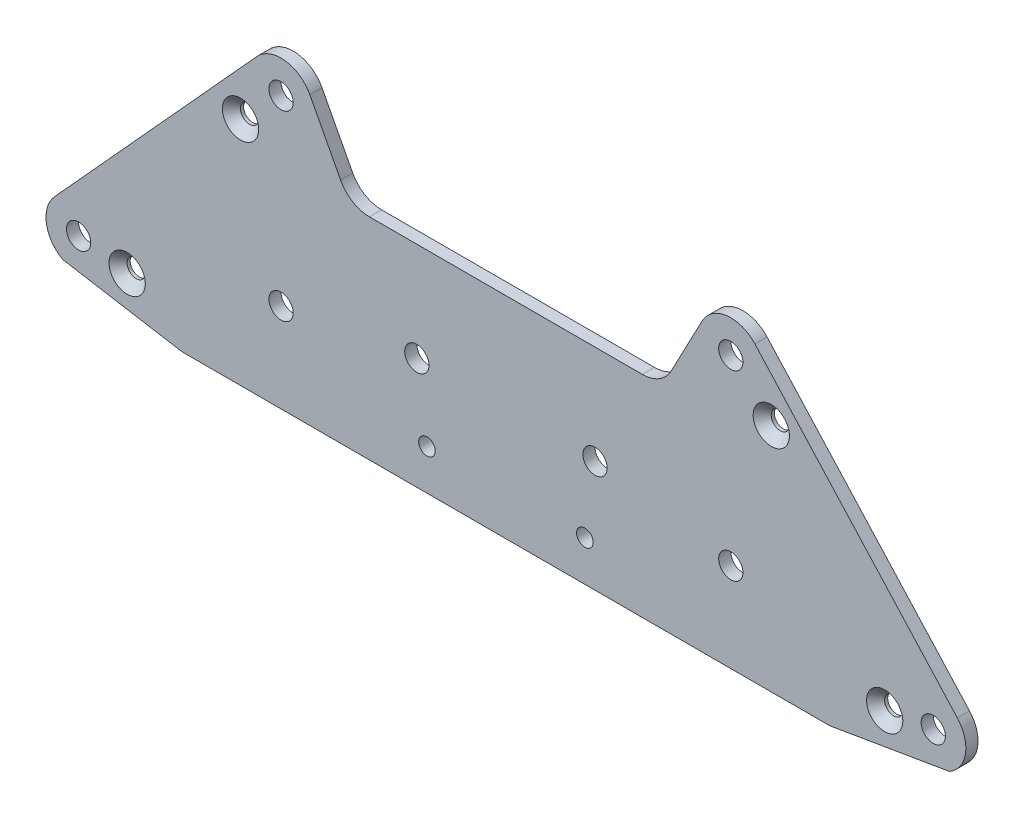
ISO-10303-21;
HEADER;
FILE_DESCRIPTION(('STEP AP214'),'2;1');
FILE_NAME('part.step','',(''),(''),'','','');
FILE_SCHEMA(('AUTOMOTIVE_DESIGN { 1 0 10303 214 1 1 1 1 }'));
ENDSEC;
DATA;
#1=APPLICATION_CONTEXT('core data for automotive mechanical design processes');
#2=APPLICATION_PROTOCOL_DEFINITION('international standard','automotive_design',2000,#1);
#3=PRODUCT_CONTEXT('',#1,'mechanical');
#4=PRODUCT('Part','Part','',(#3));
#5=PRODUCT_RELATED_PRODUCT_CATEGORY('part','',(#4));
#6=PRODUCT_DEFINITION_FORMATION('','',#4);
#7=PRODUCT_DEFINITION_CONTEXT('part definition',#1,'design');
#8=PRODUCT_DEFINITION('design','',#6,#7);
#9=PRODUCT_DEFINITION_SHAPE('','',#8);
#10=(LENGTH_UNIT() NAMED_UNIT(*) SI_UNIT(.MILLI.,.METRE.));
#11=(NAMED_UNIT(*) PLANE_ANGLE_UNIT() SI_UNIT($,.RADIAN.));
#12=(NAMED_UNIT(*) SI_UNIT($,.STERADIAN.) SOLID_ANGLE_UNIT());
#13=UNCERTAINTY_MEASURE_WITH_UNIT(LENGTH_MEASURE(1.E-05),#10,'distance_accuracy_value','');
#14=(GEOMETRIC_REPRESENTATION_CONTEXT(3) GLOBAL_UNCERTAINTY_ASSIGNED_CONTEXT((#13)) GLOBAL_UNIT_ASSIGNED_CONTEXT((#10,
#11,#12)) REPRESENTATION_CONTEXT('',''));
#15=CARTESIAN_POINT('',(0.,0.,0.));
#16=DIRECTION('',(0.,0.,1.));
#17=DIRECTION('',(1.,0.,0.));
#18=AXIS2_PLACEMENT_3D('',#15,#16,#17);
#19=CARTESIAN_POINT('',(105.536479783985,0.,3.));
#20=DIRECTION('',(0.,0.,-1.));
#21=DIRECTION('',(-1.,0.,0.));
#22=AXIS2_PLACEMENT_3D('',#19,#20,#21);
#23=PLANE('',#22);
#24=CARTESIAN_POINT('',(93.5364797839854,-2.00000000000001,3.));
#25=DIRECTION('',(0.,0.,1.));
#26=DIRECTION('',(1.,0.,0.));
#27=AXIS2_PLACEMENT_3D('',#24,#25,#26);
#28=CIRCLE('',#27,4.48);
#29=CARTESIAN_POINT('',(98.0164797839853,-2.00000000000001,3.));
#30=VERTEX_POINT('',#29);
#31=EDGE_CURVE('E369',#30,#30,#28,.T.);
#32=ORIENTED_EDGE('',*,*,#31,.F.);
#33=EDGE_LOOP('',(#32));
#34=FACE_BOUND('',#33,.T.);
#35=CARTESIAN_POINT('',(65.5364797839853,45.,3.));
#36=DIRECTION('',(0.,0.,1.));
#37=DIRECTION('',(1.,0.,0.));
#38=AXIS2_PLACEMENT_3D('',#35,#36,#37);
#39=CIRCLE('',#38,4.48);
#40=CARTESIAN_POINT('',(70.0164797839853,45.,3.));
#41=VERTEX_POINT('',#40);
#42=EDGE_CURVE('E376',#41,#41,#39,.T.);
#43=ORIENTED_EDGE('',*,*,#42,.F.);
#44=EDGE_LOOP('',(#43));
#45=FACE_BOUND('',#44,.T.);
#46=CARTESIAN_POINT('',(-65.5364797839853,45.,3.));
#47=DIRECTION('',(0.,0.,1.));
#48=DIRECTION('',(1.,0.,0.));
#49=AXIS2_PLACEMENT_3D('',#46,#47,#48);
#50=CIRCLE('',#49,4.48);
#51=CARTESIAN_POINT('',(-61.0564797839853,45.,3.));
#52=VERTEX_POINT('',#51);
#53=EDGE_CURVE('E385',#52,#52,#50,.T.);
#54=ORIENTED_EDGE('',*,*,#53,.F.);
#55=EDGE_LOOP('',(#54));
#56=FACE_BOUND('',#55,.T.);
#57=CARTESIAN_POINT('',(-93.5364797839853,-2.,3.));
#58=DIRECTION('',(0.,0.,1.));
#59=DIRECTION('',(1.,0.,0.));
#60=AXIS2_PLACEMENT_3D('',#57,#58,#59);
#61=CIRCLE('',#60,4.48);
#62=CARTESIAN_POINT('',(-89.0564797839853,-2.,3.));
#63=VERTEX_POINT('',#62);
#64=EDGE_CURVE('E394',#63,#63,#61,.T.);
#65=ORIENTED_EDGE('',*,*,#64,.F.);
#66=EDGE_LOOP('',(#65));
#67=FACE_BOUND('',#66,.T.);
#68=CARTESIAN_POINT('',(19.5,-2.,3.));
#69=DIRECTION('',(0.,0.,1.));
#70=DIRECTION('',(1.,0.,0.));
#71=AXIS2_PLACEMENT_3D('',#68,#69,#70);
#72=CIRCLE('',#71,2.04999999999999);
#73=CARTESIAN_POINT('',(21.55,-2.,3.));
#74=VERTEX_POINT('',#73);
#75=EDGE_CURVE('E403',#74,#74,#72,.T.);
#76=ORIENTED_EDGE('',*,*,#75,.F.);
#77=EDGE_LOOP('',(#76));
#78=FACE_BOUND('',#77,.T.);
#79=CARTESIAN_POINT('',(-19.5,-2.,3.));
#80=DIRECTION('',(0.,0.,1.));
#81=DIRECTION('',(1.,0.,0.));
#82=AXIS2_PLACEMENT_3D('',#79,#80,#81);
#83=CIRCLE('',#82,2.04999999999999);
#84=CARTESIAN_POINT('',(-17.45,-2.,3.));
#85=VERTEX_POINT('',#84);
#86=EDGE_CURVE('E407',#85,#85,#83,.T.);
#87=ORIENTED_EDGE('',*,*,#86,.F.);
#88=EDGE_LOOP('',(#87));
#89=FACE_BOUND('',#88,.T.);
#90=CARTESIAN_POINT('',(-21.9984081380424,15.5854946308941,3.));
#91=DIRECTION('',(0.,0.,1.));
#92=DIRECTION('',(1.,0.,0.));
#93=AXIS2_PLACEMENT_3D('',#90,#91,#92);
#94=CIRCLE('',#93,2.99999999999999);
#95=CARTESIAN_POINT('',(-18.9984081380424,15.5854946308941,3.));
#96=VERTEX_POINT('',#95);
#97=EDGE_CURVE('E422',#96,#96,#94,.T.);
#98=ORIENTED_EDGE('',*,*,#97,.F.);
#99=EDGE_LOOP('',(#98));
#100=FACE_BOUND('',#99,.T.);
#101=CARTESIAN_POINT('',(-55.5364797839854,10.,3.));
#102=DIRECTION('',(0.,0.,1.));
#103=DIRECTION('',(1.,0.,0.));
#104=AXIS2_PLACEMENT_3D('',#101,#102,#103);
#105=CIRCLE('',#104,2.99999999999999);
#106=CARTESIAN_POINT('',(-52.5364797839854,10.,3.));
#107=VERTEX_POINT('',#106);
#108=EDGE_CURVE('E434',#107,#107,#105,.T.);
#109=ORIENTED_EDGE('',*,*,#108,.F.);
#110=EDGE_LOOP('',(#109));
#111=FACE_BOUND('',#110,.T.);
#112=CARTESIAN_POINT('',(55.5364797839853,55.,3.));
#113=DIRECTION('',(0.,0.,1.));
#114=DIRECTION('',(1.,0.,0.));
#115=AXIS2_PLACEMENT_3D('',#112,#113,#114);
#116=CIRCLE('',#115,3.);
#117=CARTESIAN_POINT('',(58.5364797839853,55.,3.));
#118=VERTEX_POINT('',#117);
#119=EDGE_CURVE('E446',#118,#118,#116,.T.);
#120=ORIENTED_EDGE('',*,*,#119,.F.);
#121=EDGE_LOOP('',(#120));
#122=FACE_BOUND('',#121,.T.);
#123=CARTESIAN_POINT('',(105.536479783985,0.,3.));
#124=DIRECTION('',(0.,0.,1.));
#125=DIRECTION('',(1.,0.,0.));
#126=AXIS2_PLACEMENT_3D('',#123,#124,#125);
#127=CIRCLE('',#126,3.00000000000001);
#128=CARTESIAN_POINT('',(108.536479783985,0.,3.));
#129=VERTEX_POINT('',#128);
#130=EDGE_CURVE('E172',#129,#129,#127,.T.);
#131=ORIENTED_EDGE('',*,*,#130,.F.);
#132=EDGE_LOOP('',(#131));
#133=FACE_BOUND('',#132,.T.);
#134=DIRECTION('',(0.985942111915208,0.16708725849741,0.));
#135=VECTOR('',#134,1.);
#136=CARTESIAN_POINT('',(80.,-12.,3.));
#137=LINE('',#136,#135);
#138=CARTESIAN_POINT('',(80.,-12.,3.));
#139=VERTEX_POINT('',#138);
#140=CARTESIAN_POINT('',(109.503808991231,-6.99999999999999,3.));
#141=VERTEX_POINT('',#140);
#142=EDGE_CURVE('E195',#139,#141,#137,.T.);
#143=ORIENTED_EDGE('',*,*,#142,.T.);
#144=CARTESIAN_POINT('',(105.536479783985,0.,3.));
#145=DIRECTION('',(0.,0.,1.));
#146=DIRECTION('',(-1.,0.,0.));
#147=AXIS2_PLACEMENT_3D('',#144,#145,#146);
#148=CIRCLE('',#147,8.04609849794704);
#149=CARTESIAN_POINT('',(111.490110497107,5.41239155738356,3.));
#150=VERTEX_POINT('',#149);
#151=EDGE_CURVE('E113',#141,#150,#148,.T.);
#152=ORIENTED_EDGE('',*,*,#151,.T.);
#153=DIRECTION('',(-0.672672793996313,0.739940073395944,0.));
#154=VECTOR('',#153,1.);
#155=CARTESIAN_POINT('',(61.4901104971073,60.4123915573836,3.));
#156=LINE('',#155,#154);
#157=CARTESIAN_POINT('',(61.4901104971073,60.4123915573836,3.));
#158=VERTEX_POINT('',#157);
#159=EDGE_CURVE('E228',#150,#158,#156,.T.);
#160=ORIENTED_EDGE('',*,*,#159,.T.);
#161=CARTESIAN_POINT('',(55.5364797839853,55.,3.));
#162=DIRECTION('',(0.,0.,1.));
#163=DIRECTION('',(-1.,0.,0.));
#164=AXIS2_PLACEMENT_3D('',#161,#162,#163);
#165=CIRCLE('',#164,8.04609849794704);
#166=CARTESIAN_POINT('',(48.414233746898,58.743435911814,3.));
#167=VERTEX_POINT('',#166);
#168=EDGE_CURVE('E247',#158,#167,#165,.T.);
#169=ORIENTED_EDGE('',*,*,#168,.T.);
#170=DIRECTION('',(-0.465248581380051,-0.885180070677063,0.));
#171=VECTOR('',#170,1.);
#172=CARTESIAN_POINT('',(40.8241969551014,44.302662586133,3.));
#173=LINE('',#172,#171);
#174=CARTESIAN_POINT('',(40.8241969551014,44.302662586133,3.));
#175=VERTEX_POINT('',#174);
#176=EDGE_CURVE('E244',#167,#175,#173,.T.);
#177=ORIENTED_EDGE('',*,*,#176,.T.);
#178=CARTESIAN_POINT('',(33.701950918014,48.046098497947,3.));
#179=DIRECTION('',(0.,0.,-1.));
#180=DIRECTION('',(1.,0.,0.));
#181=AXIS2_PLACEMENT_3D('',#178,#179,#180);
#182=CIRCLE('',#181,8.04609849794704);
#183=CARTESIAN_POINT('',(33.701950918014,40.,3.));
#184=VERTEX_POINT('',#183);
#185=EDGE_CURVE('E246',#175,#184,#182,.T.);
#186=ORIENTED_EDGE('',*,*,#185,.T.);
#187=DIRECTION('',(-1.,0.,0.));
#188=VECTOR('',#187,1.);
#189=CARTESIAN_POINT('',(-33.7019509180141,40.,3.));
#190=LINE('',#189,#188);
#191=CARTESIAN_POINT('',(-33.7019509180141,40.,3.));
#192=VERTEX_POINT('',#191);
#193=EDGE_CURVE('E249',#184,#192,#190,.T.);
#194=ORIENTED_EDGE('',*,*,#193,.T.);
#195=CARTESIAN_POINT('',(-33.7019509180141,48.046098497947,3.));
#196=DIRECTION('',(0.,0.,-1.));
#197=DIRECTION('',(1.,0.,0.));
#198=AXIS2_PLACEMENT_3D('',#195,#196,#197);
#199=CIRCLE('',#198,8.04609849794705);
#200=CARTESIAN_POINT('',(-40.8241969551014,44.302662586133,3.));
#201=VERTEX_POINT('',#200);
#202=EDGE_CURVE('E255',#192,#201,#199,.T.);
#203=ORIENTED_EDGE('',*,*,#202,.T.);
#204=DIRECTION('',(-0.465248581380051,0.885180070677063,0.));
#205=VECTOR('',#204,1.);
#206=CARTESIAN_POINT('',(-48.414233746898,58.743435911814,3.));
#207=LINE('',#206,#205);
#208=CARTESIAN_POINT('',(-48.414233746898,58.743435911814,3.));
#209=VERTEX_POINT('',#208);
#210=EDGE_CURVE('E257',#201,#209,#207,.T.);
#211=ORIENTED_EDGE('',*,*,#210,.T.);
#212=CARTESIAN_POINT('',(-55.5364797839854,55.,3.));
#213=DIRECTION('',(0.,0.,1.));
#214=DIRECTION('',(-1.,0.,0.));
#215=AXIS2_PLACEMENT_3D('',#212,#213,#214);
#216=CIRCLE('',#215,8.04609849794704);
#217=CARTESIAN_POINT('',(-61.4901104971073,60.4123915573836,3.));
#218=VERTEX_POINT('',#217);
#219=EDGE_CURVE('E259',#209,#218,#216,.T.);
#220=ORIENTED_EDGE('',*,*,#219,.T.);
#221=DIRECTION('',(-0.672672793996313,-0.739940073395944,0.));
#222=VECTOR('',#221,1.);
#223=CARTESIAN_POINT('',(-111.490110497107,5.41239155738357,3.));
#224=LINE('',#223,#222);
#225=CARTESIAN_POINT('',(-111.490110497107,5.41239155738357,3.));
#226=VERTEX_POINT('',#225);
#227=EDGE_CURVE('E150',#218,#226,#224,.T.);
#228=ORIENTED_EDGE('',*,*,#227,.T.);
#229=CARTESIAN_POINT('',(-105.536479783985,0.,3.));
#230=DIRECTION('',(0.,0.,1.));
#231=DIRECTION('',(-1.,0.,0.));
#232=AXIS2_PLACEMENT_3D('',#229,#230,#231);
#233=CIRCLE('',#232,8.04609849794704);
#234=CARTESIAN_POINT('',(-109.503808991231,-7.,3.));
#235=VERTEX_POINT('',#234);
#236=EDGE_CURVE('E144',#226,#235,#233,.T.);
#237=ORIENTED_EDGE('',*,*,#236,.T.);
#238=DIRECTION('',(0.985942111915208,-0.16708725849741,0.));
#239=VECTOR('',#238,1.);
#240=CARTESIAN_POINT('',(-80.,-12.,3.));
#241=LINE('',#240,#239);
#242=CARTESIAN_POINT('',(-80.,-12.,3.));
#243=VERTEX_POINT('',#242);
#244=EDGE_CURVE('E148',#235,#243,#241,.T.);
#245=ORIENTED_EDGE('',*,*,#244,.T.);
#246=DIRECTION('',(1.,0.,0.));
#247=VECTOR('',#246,1.);
#248=CARTESIAN_POINT('',(-80.,-12.,3.));
#249=LINE('',#248,#247);
#250=EDGE_CURVE('E52',#243,#139,#249,.T.);
#251=ORIENTED_EDGE('',*,*,#250,.T.);
#252=EDGE_LOOP('',(#143,#152,#160,#169,#177,#186,#194,#203,#211,#220,#228,#237,#245,#251));
#253=FACE_BOUND('',#252,.T.);
#254=CARTESIAN_POINT('',(55.5364797839853,10.,3.));
#255=DIRECTION('',(0.,0.,1.));
#256=DIRECTION('',(1.,0.,0.));
#257=AXIS2_PLACEMENT_3D('',#254,#255,#256);
#258=CIRCLE('',#257,3.);
#259=CARTESIAN_POINT('',(58.5364797839853,10.,3.));
#260=VERTEX_POINT('',#259);
#261=EDGE_CURVE('E452',#260,#260,#258,.T.);
#262=ORIENTED_EDGE('',*,*,#261,.F.);
#263=EDGE_LOOP('',(#262));
#264=FACE_BOUND('',#263,.T.);
#265=CARTESIAN_POINT('',(-105.536479783985,0.,3.));
#266=DIRECTION('',(0.,0.,1.));
#267=DIRECTION('',(1.,0.,0.));
#268=AXIS2_PLACEMENT_3D('',#265,#266,#267);
#269=CIRCLE('',#268,2.99999999999999);
#270=CARTESIAN_POINT('',(-102.536479783985,0.,3.));
#271=VERTEX_POINT('',#270);
#272=EDGE_CURVE('E440',#271,#271,#269,.T.);
#273=ORIENTED_EDGE('',*,*,#272,.F.);
#274=EDGE_LOOP('',(#273));
#275=FACE_BOUND('',#274,.T.);
#276=CARTESIAN_POINT('',(-55.5364797839854,55.,3.));
#277=DIRECTION('',(0.,0.,1.));
#278=DIRECTION('',(1.,0.,0.));
#279=AXIS2_PLACEMENT_3D('',#276,#277,#278);
#280=CIRCLE('',#279,2.99999999999999);
#281=CARTESIAN_POINT('',(-52.5364797839854,55.,3.));
#282=VERTEX_POINT('',#281);
#283=EDGE_CURVE('E428',#282,#282,#280,.T.);
#284=ORIENTED_EDGE('',*,*,#283,.F.);
#285=EDGE_LOOP('',(#284));
#286=FACE_BOUND('',#285,.T.);
#287=CARTESIAN_POINT('',(21.9984081380424,15.5854946308941,3.));
#288=DIRECTION('',(0.,0.,1.));
#289=DIRECTION('',(1.,0.,0.));
#290=AXIS2_PLACEMENT_3D('',#287,#288,#289);
#291=CIRCLE('',#290,3.);
#292=CARTESIAN_POINT('',(24.9984081380424,15.5854946308941,3.));
#293=VERTEX_POINT('',#292);
#294=EDGE_CURVE('E416',#293,#293,#291,.T.);
#295=ORIENTED_EDGE('',*,*,#294,.F.);
#296=EDGE_LOOP('',(#295));
#297=FACE_BOUND('',#296,.T.);
#298=ADVANCED_FACE('F35',(#34,#45,#56,#67,#78,#89,#100,#111,#122,#133,#253,#264,#275,#286,#297),
#23,.F.);
#299=CARTESIAN_POINT('',(105.536479783985,0.,0.));
#300=DIRECTION('',(0.,0.,-1.));
#301=DIRECTION('',(-1.,0.,0.));
#302=AXIS2_PLACEMENT_3D('',#299,#300,#301);
#303=PLANE('',#302);
#304=CARTESIAN_POINT('',(93.5364797839854,-2.00000000000001,0.));
#305=DIRECTION('',(0.,0.,1.));
#306=DIRECTION('',(1.,0.,0.));
#307=AXIS2_PLACEMENT_3D('',#304,#305,#306);
#308=CIRCLE('',#307,2.25);
#309=CARTESIAN_POINT('',(95.7864797839854,-2.00000000000001,0.));
#310=VERTEX_POINT('',#309);
#311=EDGE_CURVE('E371',#310,#310,#308,.T.);
#312=ORIENTED_EDGE('',*,*,#311,.T.);
#313=EDGE_LOOP('',(#312));
#314=FACE_BOUND('',#313,.T.);
#315=CARTESIAN_POINT('',(65.5364797839853,45.,0.));
#316=DIRECTION('',(0.,0.,1.));
#317=DIRECTION('',(1.,0.,0.));
#318=AXIS2_PLACEMENT_3D('',#315,#316,#317);
#319=CIRCLE('',#318,2.25);
#320=CARTESIAN_POINT('',(67.7864797839853,45.,0.));
#321=VERTEX_POINT('',#320);
#322=EDGE_CURVE('E382',#321,#321,#319,.T.);
#323=ORIENTED_EDGE('',*,*,#322,.T.);
#324=EDGE_LOOP('',(#323));
#325=FACE_BOUND('',#324,.T.);
#326=CARTESIAN_POINT('',(-65.5364797839853,45.,0.));
#327=DIRECTION('',(0.,0.,1.));
#328=DIRECTION('',(1.,0.,0.));
#329=AXIS2_PLACEMENT_3D('',#326,#327,#328);
#330=CIRCLE('',#329,2.25);
#331=CARTESIAN_POINT('',(-63.2864797839853,45.,0.));
#332=VERTEX_POINT('',#331);
#333=EDGE_CURVE('E391',#332,#332,#330,.T.);
#334=ORIENTED_EDGE('',*,*,#333,.T.);
#335=EDGE_LOOP('',(#334));
#336=FACE_BOUND('',#335,.T.);
#337=CARTESIAN_POINT('',(-93.5364797839853,-2.,0.));
#338=DIRECTION('',(0.,0.,1.));
#339=DIRECTION('',(1.,0.,0.));
#340=AXIS2_PLACEMENT_3D('',#337,#338,#339);
#341=CIRCLE('',#340,2.25);
#342=CARTESIAN_POINT('',(-91.2864797839853,-2.,0.));
#343=VERTEX_POINT('',#342);
#344=EDGE_CURVE('E400',#343,#343,#341,.T.);
#345=ORIENTED_EDGE('',*,*,#344,.T.);
#346=EDGE_LOOP('',(#345));
#347=FACE_BOUND('',#346,.T.);
#348=CARTESIAN_POINT('',(19.5,-2.,0.));
#349=DIRECTION('',(0.,0.,1.));
#350=DIRECTION('',(1.,0.,0.));
#351=AXIS2_PLACEMENT_3D('',#348,#349,#350);
#352=CIRCLE('',#351,2.04999999999999);
#353=CARTESIAN_POINT('',(21.55,-2.,0.));
#354=VERTEX_POINT('',#353);
#355=EDGE_CURVE('E404',#354,#354,#352,.T.);
#356=ORIENTED_EDGE('',*,*,#355,.T.);
#357=EDGE_LOOP('',(#356));
#358=FACE_BOUND('',#357,.T.);
#359=CARTESIAN_POINT('',(-19.5,-2.,0.));
#360=DIRECTION('',(0.,0.,1.));
#361=DIRECTION('',(1.,0.,0.));
#362=AXIS2_PLACEMENT_3D('',#359,#360,#361);
#363=CIRCLE('',#362,2.04999999999999);
#364=CARTESIAN_POINT('',(-17.45,-2.,0.));
#365=VERTEX_POINT('',#364);
#366=EDGE_CURVE('E410',#365,#365,#363,.T.);
#367=ORIENTED_EDGE('',*,*,#366,.T.);
#368=EDGE_LOOP('',(#367));
#369=FACE_BOUND('',#368,.T.);
#370=CARTESIAN_POINT('',(-21.9984081380424,15.5854946308941,0.));
#371=DIRECTION('',(0.,0.,1.));
#372=DIRECTION('',(1.,0.,0.));
#373=AXIS2_PLACEMENT_3D('',#370,#371,#372);
#374=CIRCLE('',#373,2.99999999999999);
#375=CARTESIAN_POINT('',(-18.9984081380424,15.5854946308941,0.));
#376=VERTEX_POINT('',#375);
#377=EDGE_CURVE('E419',#376,#376,#374,.T.);
#378=ORIENTED_EDGE('',*,*,#377,.T.);
#379=EDGE_LOOP('',(#378));
#380=FACE_BOUND('',#379,.T.);
#381=CARTESIAN_POINT('',(-55.5364797839854,10.,0.));
#382=DIRECTION('',(0.,0.,1.));
#383=DIRECTION('',(1.,0.,0.));
#384=AXIS2_PLACEMENT_3D('',#381,#382,#383);
#385=CIRCLE('',#384,2.99999999999999);
#386=CARTESIAN_POINT('',(-52.5364797839854,10.,0.));
#387=VERTEX_POINT('',#386);
#388=EDGE_CURVE('E431',#387,#387,#385,.T.);
#389=ORIENTED_EDGE('',*,*,#388,.T.);
#390=EDGE_LOOP('',(#389));
#391=FACE_BOUND('',#390,.T.);
#392=CARTESIAN_POINT('',(55.5364797839853,55.,0.));
#393=DIRECTION('',(0.,0.,1.));
#394=DIRECTION('',(1.,0.,0.));
#395=AXIS2_PLACEMENT_3D('',#392,#393,#394);
#396=CIRCLE('',#395,3.);
#397=CARTESIAN_POINT('',(58.5364797839853,55.,0.));
#398=VERTEX_POINT('',#397);
#399=EDGE_CURVE('E443',#398,#398,#396,.T.);
#400=ORIENTED_EDGE('',*,*,#399,.T.);
#401=EDGE_LOOP('',(#400));
#402=FACE_BOUND('',#401,.T.);
#403=CARTESIAN_POINT('',(105.536479783985,0.,0.));
#404=DIRECTION('',(0.,0.,1.));
#405=DIRECTION('',(1.,0.,0.));
#406=AXIS2_PLACEMENT_3D('',#403,#404,#405);
#407=CIRCLE('',#406,3.00000000000001);
#408=CARTESIAN_POINT('',(108.536479783985,0.,0.));
#409=VERTEX_POINT('',#408);
#410=EDGE_CURVE('E455',#409,#409,#407,.T.);
#411=ORIENTED_EDGE('',*,*,#410,.T.);
#412=EDGE_LOOP('',(#411));
#413=FACE_BOUND('',#412,.T.);
#414=DIRECTION('',(0.985942111915208,0.16708725849741,0.));
#415=VECTOR('',#414,1.);
#416=CARTESIAN_POINT('',(80.,-12.,0.));
#417=LINE('',#416,#415);
#418=CARTESIAN_POINT('',(80.,-12.,0.));
#419=VERTEX_POINT('',#418);
#420=CARTESIAN_POINT('',(109.503808991231,-6.99999999999999,0.));
#421=VERTEX_POINT('',#420);
#422=EDGE_CURVE('E168',#419,#421,#417,.T.);
#423=ORIENTED_EDGE('',*,*,#422,.F.);
#424=DIRECTION('',(1.,0.,0.));
#425=VECTOR('',#424,1.);
#426=CARTESIAN_POINT('',(-80.,-12.,0.));
#427=LINE('',#426,#425);
#428=CARTESIAN_POINT('',(-80.,-12.,0.));
#429=VERTEX_POINT('',#428);
#430=EDGE_CURVE('E105',#429,#419,#427,.T.);
#431=ORIENTED_EDGE('',*,*,#430,.F.);
#432=DIRECTION('',(0.985942111915208,-0.16708725849741,0.));
#433=VECTOR('',#432,1.);
#434=CARTESIAN_POINT('',(-80.,-12.,0.));
#435=LINE('',#434,#433);
#436=CARTESIAN_POINT('',(-109.503808991231,-7.,0.));
#437=VERTEX_POINT('',#436);
#438=EDGE_CURVE('E99',#437,#429,#435,.T.);
#439=ORIENTED_EDGE('',*,*,#438,.F.);
#440=CARTESIAN_POINT('',(-105.536479783985,0.,0.));
#441=DIRECTION('',(0.,0.,1.));
#442=DIRECTION('',(-1.,0.,0.));
#443=AXIS2_PLACEMENT_3D('',#440,#441,#442);
#444=CIRCLE('',#443,8.04609849794704);
#445=CARTESIAN_POINT('',(-111.490110497107,5.41239155738357,0.));
#446=VERTEX_POINT('',#445);
#447=EDGE_CURVE('E158',#446,#437,#444,.T.);
#448=ORIENTED_EDGE('',*,*,#447,.F.);
#449=DIRECTION('',(-0.672672793996313,-0.739940073395944,0.));
#450=VECTOR('',#449,1.);
#451=CARTESIAN_POINT('',(-111.490110497107,5.41239155738357,0.));
#452=LINE('',#451,#450);
#453=CARTESIAN_POINT('',(-61.4901104971073,60.4123915573836,0.));
#454=VERTEX_POINT('',#453);
#455=EDGE_CURVE('E190',#454,#446,#452,.T.);
#456=ORIENTED_EDGE('',*,*,#455,.F.);
#457=CARTESIAN_POINT('',(-55.5364797839854,55.,0.));
#458=DIRECTION('',(0.,0.,1.));
#459=DIRECTION('',(-1.,0.,0.));
#460=AXIS2_PLACEMENT_3D('',#457,#458,#459);
#461=CIRCLE('',#460,8.04609849794704);
#462=CARTESIAN_POINT('',(-48.414233746898,58.743435911814,0.));
#463=VERTEX_POINT('',#462);
#464=EDGE_CURVE('E188',#463,#454,#461,.T.);
#465=ORIENTED_EDGE('',*,*,#464,.F.);
#466=DIRECTION('',(-0.465248581380051,0.885180070677063,0.));
#467=VECTOR('',#466,1.);
#468=CARTESIAN_POINT('',(-48.414233746898,58.743435911814,0.));
#469=LINE('',#468,#467);
#470=CARTESIAN_POINT('',(-40.8241969551014,44.302662586133,0.));
#471=VERTEX_POINT('',#470);
#472=EDGE_CURVE('E186',#471,#463,#469,.T.);
#473=ORIENTED_EDGE('',*,*,#472,.F.);
#474=CARTESIAN_POINT('',(-33.7019509180141,48.046098497947,0.));
#475=DIRECTION('',(0.,0.,-1.));
#476=DIRECTION('',(1.,0.,0.));
#477=AXIS2_PLACEMENT_3D('',#474,#475,#476);
#478=CIRCLE('',#477,8.04609849794705);
#479=CARTESIAN_POINT('',(-33.7019509180141,40.,0.));
#480=VERTEX_POINT('',#479);
#481=EDGE_CURVE('E184',#480,#471,#478,.T.);
#482=ORIENTED_EDGE('',*,*,#481,.F.);
#483=DIRECTION('',(-1.,0.,0.));
#484=VECTOR('',#483,1.);
#485=CARTESIAN_POINT('',(-33.7019509180141,40.,0.));
#486=LINE('',#485,#484);
#487=CARTESIAN_POINT('',(33.701950918014,40.,0.));
#488=VERTEX_POINT('',#487);
#489=EDGE_CURVE('E182',#488,#480,#486,.T.);
#490=ORIENTED_EDGE('',*,*,#489,.F.);
#491=CARTESIAN_POINT('',(33.701950918014,48.046098497947,0.));
#492=DIRECTION('',(0.,0.,-1.));
#493=DIRECTION('',(1.,0.,0.));
#494=AXIS2_PLACEMENT_3D('',#491,#492,#493);
#495=CIRCLE('',#494,8.04609849794704);
#496=CARTESIAN_POINT('',(40.8241969551014,44.302662586133,0.));
#497=VERTEX_POINT('',#496);
#498=EDGE_CURVE('E180',#497,#488,#495,.T.);
#499=ORIENTED_EDGE('',*,*,#498,.F.);
#500=DIRECTION('',(-0.465248581380051,-0.885180070677063,0.));
#501=VECTOR('',#500,1.);
#502=CARTESIAN_POINT('',(40.8241969551014,44.302662586133,0.));
#503=LINE('',#502,#501);
#504=CARTESIAN_POINT('',(48.414233746898,58.743435911814,0.));
#505=VERTEX_POINT('',#504);
#506=EDGE_CURVE('E178',#505,#497,#503,.T.);
#507=ORIENTED_EDGE('',*,*,#506,.F.);
#508=CARTESIAN_POINT('',(55.5364797839853,55.,0.));
#509=DIRECTION('',(0.,0.,1.));
#510=DIRECTION('',(-1.,0.,0.));
#511=AXIS2_PLACEMENT_3D('',#508,#509,#510);
#512=CIRCLE('',#511,8.04609849794704);
#513=CARTESIAN_POINT('',(61.4901104971073,60.4123915573836,0.));
#514=VERTEX_POINT('',#513);
#515=EDGE_CURVE('E176',#514,#505,#512,.T.);
#516=ORIENTED_EDGE('',*,*,#515,.F.);
#517=DIRECTION('',(-0.672672793996313,0.739940073395944,0.));
#518=VECTOR('',#517,1.);
#519=CARTESIAN_POINT('',(61.4901104971073,60.4123915573836,0.));
#520=LINE('',#519,#518);
#521=CARTESIAN_POINT('',(111.490110497107,5.41239155738356,0.));
#522=VERTEX_POINT('',#521);
#523=EDGE_CURVE('E174',#522,#514,#520,.T.);
#524=ORIENTED_EDGE('',*,*,#523,.F.);
#525=CARTESIAN_POINT('',(105.536479783985,0.,0.));
#526=DIRECTION('',(0.,0.,1.));
#527=DIRECTION('',(-1.,0.,0.));
#528=AXIS2_PLACEMENT_3D('',#525,#526,#527);
#529=CIRCLE('',#528,8.04609849794704);
#530=EDGE_CURVE('E171',#421,#522,#529,.T.);
#531=ORIENTED_EDGE('',*,*,#530,.F.);
#532=EDGE_LOOP('',(#423,#431,#439,#448,#456,#465,#473,#482,#490,#499,#507,#516,#524,#531));
#533=FACE_BOUND('',#532,.T.);
#534=CARTESIAN_POINT('',(55.5364797839853,10.,0.));
#535=DIRECTION('',(0.,0.,1.));
#536=DIRECTION('',(1.,0.,0.));
#537=AXIS2_PLACEMENT_3D('',#534,#535,#536);
#538=CIRCLE('',#537,3.);
#539=CARTESIAN_POINT('',(58.5364797839853,10.,0.));
#540=VERTEX_POINT('',#539);
#541=EDGE_CURVE('E449',#540,#540,#538,.T.);
#542=ORIENTED_EDGE('',*,*,#541,.T.);
#543=EDGE_LOOP('',(#542));
#544=FACE_BOUND('',#543,.T.);
#545=CARTESIAN_POINT('',(-105.536479783985,0.,0.));
#546=DIRECTION('',(0.,0.,1.));
#547=DIRECTION('',(1.,0.,0.));
#548=AXIS2_PLACEMENT_3D('',#545,#546,#547);
#549=CIRCLE('',#548,2.99999999999999);
#550=CARTESIAN_POINT('',(-102.536479783985,0.,0.));
#551=VERTEX_POINT('',#550);
#552=EDGE_CURVE('E437',#551,#551,#549,.T.);
#553=ORIENTED_EDGE('',*,*,#552,.T.);
#554=EDGE_LOOP('',(#553));
#555=FACE_BOUND('',#554,.T.);
#556=CARTESIAN_POINT('',(-55.5364797839854,55.,0.));
#557=DIRECTION('',(0.,0.,1.));
#558=DIRECTION('',(1.,0.,0.));
#559=AXIS2_PLACEMENT_3D('',#556,#557,#558);
#560=CIRCLE('',#559,2.99999999999999);
#561=CARTESIAN_POINT('',(-52.5364797839854,55.,0.));
#562=VERTEX_POINT('',#561);
#563=EDGE_CURVE('E425',#562,#562,#560,.T.);
#564=ORIENTED_EDGE('',*,*,#563,.T.);
#565=EDGE_LOOP('',(#564));
#566=FACE_BOUND('',#565,.T.);
#567=CARTESIAN_POINT('',(21.9984081380424,15.5854946308941,0.));
#568=DIRECTION('',(0.,0.,1.));
#569=DIRECTION('',(1.,0.,0.));
#570=AXIS2_PLACEMENT_3D('',#567,#568,#569);
#571=CIRCLE('',#570,3.);
#572=CARTESIAN_POINT('',(24.9984081380424,15.5854946308941,0.));
#573=VERTEX_POINT('',#572);
#574=EDGE_CURVE('E413',#573,#573,#571,.T.);
#575=ORIENTED_EDGE('',*,*,#574,.T.);
#576=EDGE_LOOP('',(#575));
#577=FACE_BOUND('',#576,.T.);
#578=ADVANCED_FACE('F232',(#314,#325,#336,#347,#358,#369,#380,#391,#402,#413,#533,#544,#555,
#566,#577),#303,.T.);
#579=CARTESIAN_POINT('',(80.,-12.,3.));
#580=DIRECTION('',(-0.16708725849741,0.985942111915208,0.));
#581=DIRECTION('',(-0.985942111915208,-0.16708725849741,0.));
#582=AXIS2_PLACEMENT_3D('',#579,#580,#581);
#583=PLANE('',#582);
#584=ORIENTED_EDGE('',*,*,#422,.T.);
#585=DIRECTION('',(0.,0.,-1.));
#586=VECTOR('',#585,1.);
#587=CARTESIAN_POINT('',(109.503808991231,-6.99999999999999,3.));
#588=LINE('',#587,#586);
#589=EDGE_CURVE('E11',#141,#421,#588,.T.);
#590=ORIENTED_EDGE('',*,*,#589,.F.);
#591=ORIENTED_EDGE('',*,*,#142,.F.);
#592=DIRECTION('',(0.,0.,-1.));
#593=VECTOR('',#592,1.);
#594=CARTESIAN_POINT('',(80.,-12.,3.));
#595=LINE('',#594,#593);
#596=EDGE_CURVE('E164',#139,#419,#595,.T.);
#597=ORIENTED_EDGE('',*,*,#596,.T.);
#598=EDGE_LOOP('',(#584,#590,#591,#597));
#599=FACE_BOUND('',#598,.T.);
#600=ADVANCED_FACE('F37',(#599),#583,.F.);
#601=CARTESIAN_POINT('',(105.536479783985,0.,3.));
#602=DIRECTION('',(0.,0.,-1.));
#603=DIRECTION('',(-1.,0.,0.));
#604=AXIS2_PLACEMENT_3D('',#601,#602,#603);
#605=CYLINDRICAL_SURFACE('',#604,8.04609849794704);
#606=ORIENTED_EDGE('',*,*,#530,.T.);
#607=DIRECTION('',(0.,0.,-1.));
#608=VECTOR('',#607,1.);
#609=CARTESIAN_POINT('',(111.490110497107,5.41239155738356,3.));
#610=LINE('',#609,#608);
#611=EDGE_CURVE('E44',#150,#522,#610,.T.);
#612=ORIENTED_EDGE('',*,*,#611,.F.);
#613=ORIENTED_EDGE('',*,*,#151,.F.);
#614=ORIENTED_EDGE('',*,*,#589,.T.);
#615=EDGE_LOOP('',(#606,#612,#613,#614));
#616=FACE_BOUND('',#615,.T.);
#617=ADVANCED_FACE('F703',(#616),#605,.T.);
#618=CARTESIAN_POINT('',(61.4901104971073,60.4123915573836,3.));
#619=DIRECTION('',(-0.739940073395944,-0.672672793996313,0.));
#620=DIRECTION('',(0.672672793996313,-0.739940073395944,0.));
#621=AXIS2_PLACEMENT_3D('',#618,#619,#620);
#622=PLANE('',#621);
#623=ORIENTED_EDGE('',*,*,#523,.T.);
#624=DIRECTION('',(0.,0.,-1.));
#625=VECTOR('',#624,1.);
#626=CARTESIAN_POINT('',(61.4901104971073,60.4123915573836,3.));
#627=LINE('',#626,#625);
#628=EDGE_CURVE('E220',#158,#514,#627,.T.);
#629=ORIENTED_EDGE('',*,*,#628,.F.);
#630=ORIENTED_EDGE('',*,*,#159,.F.);
#631=ORIENTED_EDGE('',*,*,#611,.T.);
#632=EDGE_LOOP('',(#623,#629,#630,#631));
#633=FACE_BOUND('',#632,.T.);
#634=ADVANCED_FACE('F226',(#633),#622,.F.);
#635=CARTESIAN_POINT('',(55.5364797839853,55.,3.));
#636=DIRECTION('',(0.,0.,-1.));
#637=DIRECTION('',(-1.,0.,0.));
#638=AXIS2_PLACEMENT_3D('',#635,#636,#637);
#639=CYLINDRICAL_SURFACE('',#638,8.04609849794704);
#640=ORIENTED_EDGE('',*,*,#515,.T.);
#641=DIRECTION('',(0.,0.,-1.));
#642=VECTOR('',#641,1.);
#643=CARTESIAN_POINT('',(48.414233746898,58.743435911814,3.));
#644=LINE('',#643,#642);
#645=EDGE_CURVE('E217',#167,#505,#644,.T.);
#646=ORIENTED_EDGE('',*,*,#645,.F.);
#647=ORIENTED_EDGE('',*,*,#168,.F.);
#648=ORIENTED_EDGE('',*,*,#628,.T.);
#649=EDGE_LOOP('',(#640,#646,#647,#648));
#650=FACE_BOUND('',#649,.T.);
#651=ADVANCED_FACE('F238',(#650),#639,.T.);
#652=CARTESIAN_POINT('',(40.8241969551014,44.302662586133,3.));
#653=DIRECTION('',(0.885180070677063,-0.465248581380051,0.));
#654=DIRECTION('',(0.465248581380051,0.885180070677063,0.));
#655=AXIS2_PLACEMENT_3D('',#652,#653,#654);
#656=PLANE('',#655);
#657=ORIENTED_EDGE('',*,*,#506,.T.);
#658=DIRECTION('',(0.,0.,-1.));
#659=VECTOR('',#658,1.);
#660=CARTESIAN_POINT('',(40.8241969551014,44.302662586133,3.));
#661=LINE('',#660,#659);
#662=EDGE_CURVE('E214',#175,#497,#661,.T.);
#663=ORIENTED_EDGE('',*,*,#662,.F.);
#664=ORIENTED_EDGE('',*,*,#176,.F.);
#665=ORIENTED_EDGE('',*,*,#645,.T.);
#666=EDGE_LOOP('',(#657,#663,#664,#665));
#667=FACE_BOUND('',#666,.T.);
#668=ADVANCED_FACE('F242',(#667),#656,.F.);
#669=CARTESIAN_POINT('',(33.701950918014,48.046098497947,3.));
#670=DIRECTION('',(0.,0.,-1.));
#671=DIRECTION('',(-1.,0.,0.));
#672=AXIS2_PLACEMENT_3D('',#669,#670,#671);
#673=CYLINDRICAL_SURFACE('',#672,8.04609849794704);
#674=ORIENTED_EDGE('',*,*,#498,.T.);
#675=DIRECTION('',(0.,0.,-1.));
#676=VECTOR('',#675,1.);
#677=CARTESIAN_POINT('',(33.701950918014,40.,3.));
#678=LINE('',#677,#676);
#679=EDGE_CURVE('E211',#184,#488,#678,.T.);
#680=ORIENTED_EDGE('',*,*,#679,.F.);
#681=ORIENTED_EDGE('',*,*,#185,.F.);
#682=ORIENTED_EDGE('',*,*,#662,.T.);
#683=EDGE_LOOP('',(#674,#680,#681,#682));
#684=FACE_BOUND('',#683,.T.);
#685=ADVANCED_FACE('F668',(#684),#673,.F.);
#686=CARTESIAN_POINT('',(-33.7019509180141,40.,3.));
#687=DIRECTION('',(0.,-1.,0.));
#688=DIRECTION('',(1.,0.,0.));
#689=AXIS2_PLACEMENT_3D('',#686,#687,#688);
#690=PLANE('',#689);
#691=ORIENTED_EDGE('',*,*,#489,.T.);
#692=DIRECTION('',(0.,0.,-1.));
#693=VECTOR('',#692,1.);
#694=CARTESIAN_POINT('',(-33.7019509180141,40.,3.));
#695=LINE('',#694,#693);
#696=EDGE_CURVE('E208',#192,#480,#695,.T.);
#697=ORIENTED_EDGE('',*,*,#696,.F.);
#698=ORIENTED_EDGE('',*,*,#193,.F.);
#699=ORIENTED_EDGE('',*,*,#679,.T.);
#700=EDGE_LOOP('',(#691,#697,#698,#699));
#701=FACE_BOUND('',#700,.T.);
#702=ADVANCED_FACE('F658',(#701),#690,.F.);
#703=CARTESIAN_POINT('',(-33.7019509180141,48.046098497947,3.));
#704=DIRECTION('',(0.,0.,-1.));
#705=DIRECTION('',(-1.,0.,0.));
#706=AXIS2_PLACEMENT_3D('',#703,#704,#705);
#707=CYLINDRICAL_SURFACE('',#706,8.04609849794705);
#708=ORIENTED_EDGE('',*,*,#481,.T.);
#709=DIRECTION('',(0.,0.,-1.));
#710=VECTOR('',#709,1.);
#711=CARTESIAN_POINT('',(-40.8241969551014,44.302662586133,3.));
#712=LINE('',#711,#710);
#713=EDGE_CURVE('E205',#201,#471,#712,.T.);
#714=ORIENTED_EDGE('',*,*,#713,.F.);
#715=ORIENTED_EDGE('',*,*,#202,.F.);
#716=ORIENTED_EDGE('',*,*,#696,.T.);
#717=EDGE_LOOP('',(#708,#714,#715,#716));
#718=FACE_BOUND('',#717,.T.);
#719=ADVANCED_FACE('F648',(#718),#707,.F.);
#720=CARTESIAN_POINT('',(-48.414233746898,58.743435911814,3.));
#721=DIRECTION('',(-0.885180070677063,-0.465248581380051,0.));
#722=DIRECTION('',(0.465248581380051,-0.885180070677063,0.));
#723=AXIS2_PLACEMENT_3D('',#720,#721,#722);
#724=PLANE('',#723);
#725=ORIENTED_EDGE('',*,*,#472,.T.);
#726=DIRECTION('',(0.,0.,-1.));
#727=VECTOR('',#726,1.);
#728=CARTESIAN_POINT('',(-48.414233746898,58.743435911814,3.));
#729=LINE('',#728,#727);
#730=EDGE_CURVE('E202',#209,#463,#729,.T.);
#731=ORIENTED_EDGE('',*,*,#730,.F.);
#732=ORIENTED_EDGE('',*,*,#210,.F.);
#733=ORIENTED_EDGE('',*,*,#713,.T.);
#734=EDGE_LOOP('',(#725,#731,#732,#733));
#735=FACE_BOUND('',#734,.T.);
#736=ADVANCED_FACE('F639',(#735),#724,.F.);
#737=CARTESIAN_POINT('',(-55.5364797839854,55.,3.));
#738=DIRECTION('',(0.,0.,-1.));
#739=DIRECTION('',(-1.,0.,0.));
#740=AXIS2_PLACEMENT_3D('',#737,#738,#739);
#741=CYLINDRICAL_SURFACE('',#740,8.04609849794704);
#742=ORIENTED_EDGE('',*,*,#464,.T.);
#743=DIRECTION('',(0.,0.,-1.));
#744=VECTOR('',#743,1.);
#745=CARTESIAN_POINT('',(-61.4901104971073,60.4123915573836,3.));
#746=LINE('',#745,#744);
#747=EDGE_CURVE('E199',#218,#454,#746,.T.);
#748=ORIENTED_EDGE('',*,*,#747,.F.);
#749=ORIENTED_EDGE('',*,*,#219,.F.);
#750=ORIENTED_EDGE('',*,*,#730,.T.);
#751=EDGE_LOOP('',(#742,#748,#749,#750));
#752=FACE_BOUND('',#751,.T.);
#753=ADVANCED_FACE('F265',(#752),#741,.T.);
#754=CARTESIAN_POINT('',(-111.490110497107,5.41239155738357,3.));
#755=DIRECTION('',(0.739940073395944,-0.672672793996313,0.));
#756=DIRECTION('',(0.672672793996313,0.739940073395944,0.));
#757=AXIS2_PLACEMENT_3D('',#754,#755,#756);
#758=PLANE('',#757);
#759=ORIENTED_EDGE('',*,*,#455,.T.);
#760=DIRECTION('',(0.,0.,-1.));
#761=VECTOR('',#760,1.);
#762=CARTESIAN_POINT('',(-111.490110497107,5.41239155738357,3.));
#763=LINE('',#762,#761);
#764=EDGE_CURVE('E159',#226,#446,#763,.T.);
#765=ORIENTED_EDGE('',*,*,#764,.F.);
#766=ORIENTED_EDGE('',*,*,#227,.F.);
#767=ORIENTED_EDGE('',*,*,#747,.T.);
#768=EDGE_LOOP('',(#759,#765,#766,#767));
#769=FACE_BOUND('',#768,.T.);
#770=ADVANCED_FACE('F269',(#769),#758,.F.);
#771=CARTESIAN_POINT('',(-105.536479783985,0.,3.));
#772=DIRECTION('',(0.,0.,-1.));
#773=DIRECTION('',(-1.,0.,0.));
#774=AXIS2_PLACEMENT_3D('',#771,#772,#773);
#775=CYLINDRICAL_SURFACE('',#774,8.04609849794704);
#776=ORIENTED_EDGE('',*,*,#447,.T.);
#777=DIRECTION('',(0.,0.,-1.));
#778=VECTOR('',#777,1.);
#779=CARTESIAN_POINT('',(-109.503808991231,-7.,3.));
#780=LINE('',#779,#778);
#781=EDGE_CURVE('E155',#235,#437,#780,.T.);
#782=ORIENTED_EDGE('',*,*,#781,.F.);
#783=ORIENTED_EDGE('',*,*,#236,.F.);
#784=ORIENTED_EDGE('',*,*,#764,.T.);
#785=EDGE_LOOP('',(#776,#782,#783,#784));
#786=FACE_BOUND('',#785,.T.);
#787=ADVANCED_FACE('F156',(#786),#775,.T.);
#788=CARTESIAN_POINT('',(-80.,-12.,3.));
#789=DIRECTION('',(0.16708725849741,0.985942111915208,0.));
#790=DIRECTION('',(-0.985942111915208,0.16708725849741,0.));
#791=AXIS2_PLACEMENT_3D('',#788,#789,#790);
#792=PLANE('',#791);
#793=ORIENTED_EDGE('',*,*,#438,.T.);
#794=DIRECTION('',(0.,0.,-1.));
#795=VECTOR('',#794,1.);
#796=CARTESIAN_POINT('',(-80.,-12.,3.));
#797=LINE('',#796,#795);
#798=EDGE_CURVE('E160',#243,#429,#797,.T.);
#799=ORIENTED_EDGE('',*,*,#798,.F.);
#800=ORIENTED_EDGE('',*,*,#244,.F.);
#801=ORIENTED_EDGE('',*,*,#781,.T.);
#802=EDGE_LOOP('',(#793,#799,#800,#801));
#803=FACE_BOUND('',#802,.T.);
#804=ADVANCED_FACE('F162',(#803),#792,.F.);
#805=CARTESIAN_POINT('',(-80.,-12.,3.));
#806=DIRECTION('',(0.,1.,0.));
#807=DIRECTION('',(0.,0.,1.));
#808=AXIS2_PLACEMENT_3D('',#805,#806,#807);
#809=PLANE('',#808);
#810=ORIENTED_EDGE('',*,*,#430,.T.);
#811=ORIENTED_EDGE('',*,*,#596,.F.);
#812=ORIENTED_EDGE('',*,*,#250,.F.);
#813=ORIENTED_EDGE('',*,*,#798,.T.);
#814=EDGE_LOOP('',(#810,#811,#812,#813));
#815=FACE_BOUND('',#814,.T.);
#816=ADVANCED_FACE('F273',(#815),#809,.F.);
#817=CARTESIAN_POINT('',(105.536479783985,0.,3.));
#818=DIRECTION('',(0.,0.,-1.));
#819=DIRECTION('',(-1.,0.,0.));
#820=AXIS2_PLACEMENT_3D('',#817,#818,#819);
#821=CYLINDRICAL_SURFACE('',#820,3.00000000000001);
#822=ORIENTED_EDGE('',*,*,#130,.T.);
#823=EDGE_LOOP('',(#822));
#824=FACE_BOUND('',#823,.T.);
#825=ORIENTED_EDGE('',*,*,#410,.F.);
#826=EDGE_LOOP('',(#825));
#827=FACE_BOUND('',#826,.T.);
#828=ADVANCED_FACE('F275',(#824,#827),#821,.F.);
#829=CARTESIAN_POINT('',(55.5364797839853,10.,3.));
#830=DIRECTION('',(0.,0.,-1.));
#831=DIRECTION('',(-1.,0.,0.));
#832=AXIS2_PLACEMENT_3D('',#829,#830,#831);
#833=CYLINDRICAL_SURFACE('',#832,3.);
#834=ORIENTED_EDGE('',*,*,#261,.T.);
#835=EDGE_LOOP('',(#834));
#836=FACE_BOUND('',#835,.T.);
#837=ORIENTED_EDGE('',*,*,#541,.F.);
#838=EDGE_LOOP('',(#837));
#839=FACE_BOUND('',#838,.T.);
#840=ADVANCED_FACE('F281',(#836,#839),#833,.F.);
#841=CARTESIAN_POINT('',(55.5364797839853,55.,3.));
#842=DIRECTION('',(0.,0.,-1.));
#843=DIRECTION('',(-1.,0.,0.));
#844=AXIS2_PLACEMENT_3D('',#841,#842,#843);
#845=CYLINDRICAL_SURFACE('',#844,3.);
#846=ORIENTED_EDGE('',*,*,#119,.T.);
#847=EDGE_LOOP('',(#846));
#848=FACE_BOUND('',#847,.T.);
#849=ORIENTED_EDGE('',*,*,#399,.F.);
#850=EDGE_LOOP('',(#849));
#851=FACE_BOUND('',#850,.T.);
#852=ADVANCED_FACE('F298',(#848,#851),#845,.F.);
#853=CARTESIAN_POINT('',(-105.536479783985,0.,3.));
#854=DIRECTION('',(0.,0.,-1.));
#855=DIRECTION('',(-1.,0.,0.));
#856=AXIS2_PLACEMENT_3D('',#853,#854,#855);
#857=CYLINDRICAL_SURFACE('',#856,2.99999999999999);
#858=ORIENTED_EDGE('',*,*,#272,.T.);
#859=EDGE_LOOP('',(#858));
#860=FACE_BOUND('',#859,.T.);
#861=ORIENTED_EDGE('',*,*,#552,.F.);
#862=EDGE_LOOP('',(#861));
#863=FACE_BOUND('',#862,.T.);
#864=ADVANCED_FACE('F302',(#860,#863),#857,.F.);
#865=CARTESIAN_POINT('',(-55.5364797839854,10.,3.));
#866=DIRECTION('',(0.,0.,-1.));
#867=DIRECTION('',(-1.,0.,0.));
#868=AXIS2_PLACEMENT_3D('',#865,#866,#867);
#869=CYLINDRICAL_SURFACE('',#868,2.99999999999999);
#870=ORIENTED_EDGE('',*,*,#108,.T.);
#871=EDGE_LOOP('',(#870));
#872=FACE_BOUND('',#871,.T.);
#873=ORIENTED_EDGE('',*,*,#388,.F.);
#874=EDGE_LOOP('',(#873));
#875=FACE_BOUND('',#874,.T.);
#876=ADVANCED_FACE('F306',(#872,#875),#869,.F.);
#877=CARTESIAN_POINT('',(-55.5364797839854,55.,3.));
#878=DIRECTION('',(0.,0.,-1.));
#879=DIRECTION('',(-1.,0.,0.));
#880=AXIS2_PLACEMENT_3D('',#877,#878,#879);
#881=CYLINDRICAL_SURFACE('',#880,2.99999999999999);
#882=ORIENTED_EDGE('',*,*,#283,.T.);
#883=EDGE_LOOP('',(#882));
#884=FACE_BOUND('',#883,.T.);
#885=ORIENTED_EDGE('',*,*,#563,.F.);
#886=EDGE_LOOP('',(#885));
#887=FACE_BOUND('',#886,.T.);
#888=ADVANCED_FACE('F310',(#884,#887),#881,.F.);
#889=CARTESIAN_POINT('',(-21.9984081380424,15.5854946308941,3.));
#890=DIRECTION('',(0.,0.,-1.));
#891=DIRECTION('',(-1.,0.,0.));
#892=AXIS2_PLACEMENT_3D('',#889,#890,#891);
#893=CYLINDRICAL_SURFACE('',#892,2.99999999999999);
#894=ORIENTED_EDGE('',*,*,#97,.T.);
#895=EDGE_LOOP('',(#894));
#896=FACE_BOUND('',#895,.T.);
#897=ORIENTED_EDGE('',*,*,#377,.F.);
#898=EDGE_LOOP('',(#897));
#899=FACE_BOUND('',#898,.T.);
#900=ADVANCED_FACE('F314',(#896,#899),#893,.F.);
#901=CARTESIAN_POINT('',(21.9984081380424,15.5854946308941,3.));
#902=DIRECTION('',(0.,0.,-1.));
#903=DIRECTION('',(-1.,0.,0.));
#904=AXIS2_PLACEMENT_3D('',#901,#902,#903);
#905=CYLINDRICAL_SURFACE('',#904,3.);
#906=ORIENTED_EDGE('',*,*,#294,.T.);
#907=EDGE_LOOP('',(#906));
#908=FACE_BOUND('',#907,.T.);
#909=ORIENTED_EDGE('',*,*,#574,.F.);
#910=EDGE_LOOP('',(#909));
#911=FACE_BOUND('',#910,.T.);
#912=ADVANCED_FACE('F318',(#908,#911),#905,.F.);
#913=CARTESIAN_POINT('',(-19.5,-2.,0.));
#914=DIRECTION('',(0.,0.,1.));
#915=DIRECTION('',(1.,0.,0.));
#916=AXIS2_PLACEMENT_3D('',#913,#914,#915);
#917=CYLINDRICAL_SURFACE('',#916,2.04999999999999);
#918=ORIENTED_EDGE('',*,*,#366,.F.);
#919=EDGE_LOOP('',(#918));
#920=FACE_BOUND('',#919,.T.);
#921=ORIENTED_EDGE('',*,*,#86,.T.);
#922=EDGE_LOOP('',(#921));
#923=FACE_BOUND('',#922,.T.);
#924=ADVANCED_FACE('F322',(#920,#923),#917,.F.);
#925=CARTESIAN_POINT('',(19.5,-2.,0.));
#926=DIRECTION('',(0.,0.,1.));
#927=DIRECTION('',(1.,0.,0.));
#928=AXIS2_PLACEMENT_3D('',#925,#926,#927);
#929=CYLINDRICAL_SURFACE('',#928,2.04999999999999);
#930=ORIENTED_EDGE('',*,*,#355,.F.);
#931=EDGE_LOOP('',(#930));
#932=FACE_BOUND('',#931,.T.);
#933=ORIENTED_EDGE('',*,*,#75,.T.);
#934=EDGE_LOOP('',(#933));
#935=FACE_BOUND('',#934,.T.);
#936=ADVANCED_FACE('F326',(#932,#935),#929,.F.);
#937=CARTESIAN_POINT('',(-93.5364797839853,-2.,3.));
#938=DIRECTION('',(0.,0.,1.));
#939=DIRECTION('',(1.,0.,0.));
#940=AXIS2_PLACEMENT_3D('',#937,#938,#939);
#941=CYLINDRICAL_SURFACE('',#940,2.25);
#942=ORIENTED_EDGE('',*,*,#344,.F.);
#943=EDGE_LOOP('',(#942));
#944=FACE_BOUND('',#943,.T.);
#945=CARTESIAN_POINT('',(-93.5364797839853,-2.,0.770000000000001));
#946=DIRECTION('',(0.,0.,1.));
#947=DIRECTION('',(1.,0.,0.));
#948=AXIS2_PLACEMENT_3D('',#945,#946,#947);
#949=CIRCLE('',#948,2.25);
#950=CARTESIAN_POINT('',(-91.2864797839853,-2.,0.770000000000001));
#951=VERTEX_POINT('',#950);
#952=EDGE_CURVE('E397',#951,#951,#949,.T.);
#953=ORIENTED_EDGE('',*,*,#952,.T.);
#954=EDGE_LOOP('',(#953));
#955=FACE_BOUND('',#954,.T.);
#956=ADVANCED_FACE('F330',(#944,#955),#941,.F.);
#957=CARTESIAN_POINT('',(-93.5364797839853,-2.,3.));
#958=DIRECTION('',(0.,0.,1.));
#959=DIRECTION('',(1.,0.,0.));
#960=AXIS2_PLACEMENT_3D('',#957,#958,#959);
#961=CONICAL_SURFACE('',#960,4.48,0.785398163397448);
#962=ORIENTED_EDGE('',*,*,#952,.F.);
#963=EDGE_LOOP('',(#962));
#964=FACE_BOUND('',#963,.T.);
#965=ORIENTED_EDGE('',*,*,#64,.T.);
#966=EDGE_LOOP('',(#965));
#967=FACE_BOUND('',#966,.T.);
#968=ADVANCED_FACE('F334',(#964,#967),#961,.F.);
#969=CARTESIAN_POINT('',(-65.5364797839853,45.,3.));
#970=DIRECTION('',(0.,0.,1.));
#971=DIRECTION('',(1.,0.,0.));
#972=AXIS2_PLACEMENT_3D('',#969,#970,#971);
#973=CYLINDRICAL_SURFACE('',#972,2.25);
#974=ORIENTED_EDGE('',*,*,#333,.F.);
#975=EDGE_LOOP('',(#974));
#976=FACE_BOUND('',#975,.T.);
#977=CARTESIAN_POINT('',(-65.5364797839853,45.,0.770000000000001));
#978=DIRECTION('',(0.,0.,1.));
#979=DIRECTION('',(1.,0.,0.));
#980=AXIS2_PLACEMENT_3D('',#977,#978,#979);
#981=CIRCLE('',#980,2.25);
#982=CARTESIAN_POINT('',(-63.2864797839853,45.,0.770000000000001));
#983=VERTEX_POINT('',#982);
#984=EDGE_CURVE('E388',#983,#983,#981,.T.);
#985=ORIENTED_EDGE('',*,*,#984,.T.);
#986=EDGE_LOOP('',(#985));
#987=FACE_BOUND('',#986,.T.);
#988=ADVANCED_FACE('F338',(#976,#987),#973,.F.);
#989=CARTESIAN_POINT('',(-65.5364797839853,45.,3.));
#990=DIRECTION('',(0.,0.,1.));
#991=DIRECTION('',(1.,0.,0.));
#992=AXIS2_PLACEMENT_3D('',#989,#990,#991);
#993=CONICAL_SURFACE('',#992,4.48,0.785398163397448);
#994=ORIENTED_EDGE('',*,*,#984,.F.);
#995=EDGE_LOOP('',(#994));
#996=FACE_BOUND('',#995,.T.);
#997=ORIENTED_EDGE('',*,*,#53,.T.);
#998=EDGE_LOOP('',(#997));
#999=FACE_BOUND('',#998,.T.);
#1000=ADVANCED_FACE('F342',(#996,#999),#993,.F.);
#1001=CARTESIAN_POINT('',(65.5364797839853,45.,3.));
#1002=DIRECTION('',(0.,0.,1.));
#1003=DIRECTION('',(1.,0.,0.));
#1004=AXIS2_PLACEMENT_3D('',#1001,#1002,#1003);
#1005=CYLINDRICAL_SURFACE('',#1004,2.25);
#1006=ORIENTED_EDGE('',*,*,#322,.F.);
#1007=EDGE_LOOP('',(#1006));
#1008=FACE_BOUND('',#1007,.T.);
#1009=CARTESIAN_POINT('',(65.5364797839853,45.,0.770000000000001));
#1010=DIRECTION('',(0.,0.,1.));
#1011=DIRECTION('',(1.,0.,0.));
#1012=AXIS2_PLACEMENT_3D('',#1009,#1010,#1011);
#1013=CIRCLE('',#1012,2.25);
#1014=CARTESIAN_POINT('',(67.7864797839853,45.,0.770000000000001));
#1015=VERTEX_POINT('',#1014);
#1016=EDGE_CURVE('E379',#1015,#1015,#1013,.T.);
#1017=ORIENTED_EDGE('',*,*,#1016,.T.);
#1018=EDGE_LOOP('',(#1017));
#1019=FACE_BOUND('',#1018,.T.);
#1020=ADVANCED_FACE('F346',(#1008,#1019),#1005,.F.);
#1021=CARTESIAN_POINT('',(65.5364797839853,45.,3.));
#1022=DIRECTION('',(0.,0.,1.));
#1023=DIRECTION('',(1.,0.,0.));
#1024=AXIS2_PLACEMENT_3D('',#1021,#1022,#1023);
#1025=CONICAL_SURFACE('',#1024,4.48,0.785398163397448);
#1026=ORIENTED_EDGE('',*,*,#1016,.F.);
#1027=EDGE_LOOP('',(#1026));
#1028=FACE_BOUND('',#1027,.T.);
#1029=ORIENTED_EDGE('',*,*,#42,.T.);
#1030=EDGE_LOOP('',(#1029));
#1031=FACE_BOUND('',#1030,.T.);
#1032=ADVANCED_FACE('F350',(#1028,#1031),#1025,.F.);
#1033=CARTESIAN_POINT('',(93.5364797839854,-2.00000000000001,3.));
#1034=DIRECTION('',(0.,0.,1.));
#1035=DIRECTION('',(1.,0.,0.));
#1036=AXIS2_PLACEMENT_3D('',#1033,#1034,#1035);
#1037=CYLINDRICAL_SURFACE('',#1036,2.25);
#1038=ORIENTED_EDGE('',*,*,#311,.F.);
#1039=EDGE_LOOP('',(#1038));
#1040=FACE_BOUND('',#1039,.T.);
#1041=CARTESIAN_POINT('',(93.5364797839854,-2.00000000000001,0.770000000000001));
#1042=DIRECTION('',(0.,0.,1.));
#1043=DIRECTION('',(1.,0.,0.));
#1044=AXIS2_PLACEMENT_3D('',#1041,#1042,#1043);
#1045=CIRCLE('',#1044,2.25);
#1046=CARTESIAN_POINT('',(95.7864797839854,-2.00000000000001,0.770000000000001));
#1047=VERTEX_POINT('',#1046);
#1048=EDGE_CURVE('E367',#1047,#1047,#1045,.T.);
#1049=ORIENTED_EDGE('',*,*,#1048,.T.);
#1050=EDGE_LOOP('',(#1049));
#1051=FACE_BOUND('',#1050,.T.);
#1052=ADVANCED_FACE('F354',(#1040,#1051),#1037,.F.);
#1053=CARTESIAN_POINT('',(93.5364797839854,-2.00000000000001,3.));
#1054=DIRECTION('',(0.,0.,1.));
#1055=DIRECTION('',(1.,0.,0.));
#1056=AXIS2_PLACEMENT_3D('',#1053,#1054,#1055);
#1057=CONICAL_SURFACE('',#1056,4.48,0.785398163397448);
#1058=ORIENTED_EDGE('',*,*,#1048,.F.);
#1059=EDGE_LOOP('',(#1058));
#1060=FACE_BOUND('',#1059,.T.);
#1061=ORIENTED_EDGE('',*,*,#31,.T.);
#1062=EDGE_LOOP('',(#1061));
#1063=FACE_BOUND('',#1062,.T.);
#1064=ADVANCED_FACE('F358',(#1060,#1063),#1057,.F.);
#1065=CLOSED_SHELL('',(#298,#578,#600,#617,#634,#651,#668,#685,#702,#719,#736,#753,#770,#787,
#804,#816,#828,#840,#852,#864,#876,#888,#900,#912,#924,#936,#956,#968,#988,#1000,#1020,#1032,
#1052,#1064));
#1066=MANIFOLD_SOLID_BREP('B2',#1065);
#1067=ADVANCED_BREP_SHAPE_REPRESENTATION('',(#18,#1066),#14);
#1068=SHAPE_DEFINITION_REPRESENTATION(#9,#1067);
ENDSEC;
END-ISO-10303-21;
